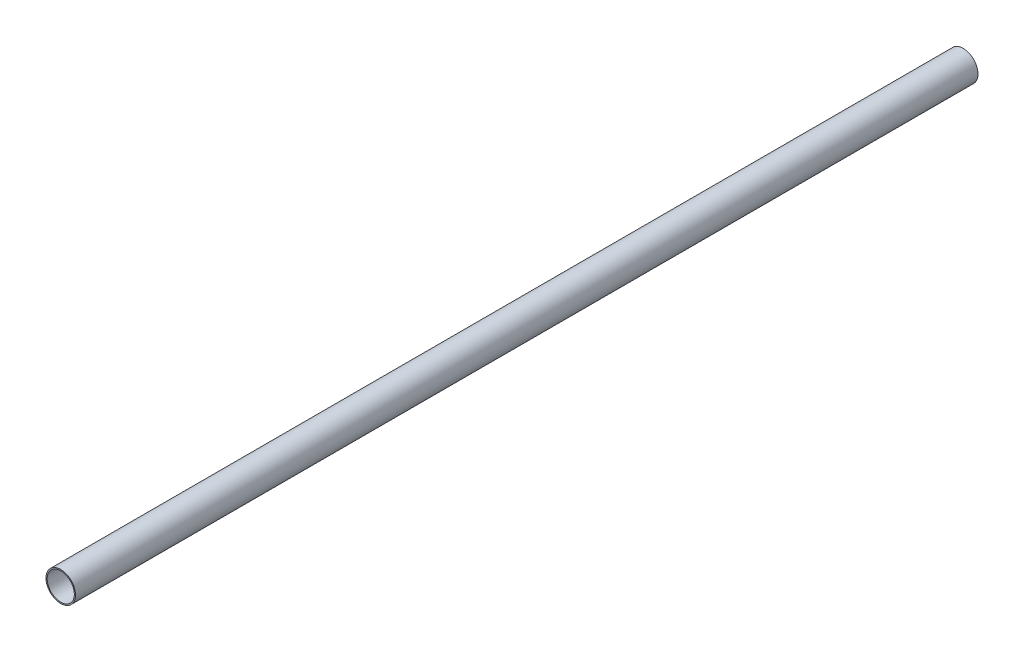
ISO-10303-21;
HEADER;
FILE_DESCRIPTION(('STEP AP214'),'2;1');
FILE_NAME('part.step','',(''),(''),'','','');
FILE_SCHEMA(('AUTOMOTIVE_DESIGN { 1 0 10303 214 1 1 1 1 }'));
ENDSEC;
DATA;
#1=APPLICATION_CONTEXT('core data for automotive mechanical design processes');
#2=APPLICATION_PROTOCOL_DEFINITION('international standard','automotive_design',2000,#1);
#3=PRODUCT_CONTEXT('',#1,'mechanical');
#4=PRODUCT('Part','Part','',(#3));
#5=PRODUCT_RELATED_PRODUCT_CATEGORY('part','',(#4));
#6=PRODUCT_DEFINITION_FORMATION('','',#4);
#7=PRODUCT_DEFINITION_CONTEXT('part definition',#1,'design');
#8=PRODUCT_DEFINITION('design','',#6,#7);
#9=PRODUCT_DEFINITION_SHAPE('','',#8);
#10=(LENGTH_UNIT() NAMED_UNIT(*) SI_UNIT(.MILLI.,.METRE.));
#11=(NAMED_UNIT(*) PLANE_ANGLE_UNIT() SI_UNIT($,.RADIAN.));
#12=(NAMED_UNIT(*) SI_UNIT($,.STERADIAN.) SOLID_ANGLE_UNIT());
#13=UNCERTAINTY_MEASURE_WITH_UNIT(LENGTH_MEASURE(1.E-05),#10,'distance_accuracy_value','');
#14=(GEOMETRIC_REPRESENTATION_CONTEXT(3) GLOBAL_UNCERTAINTY_ASSIGNED_CONTEXT((#13)) GLOBAL_UNIT_ASSIGNED_CONTEXT((#10,
#11,#12)) REPRESENTATION_CONTEXT('',''));
#15=CARTESIAN_POINT('',(0.,0.,0.));
#16=DIRECTION('',(0.,0.,1.));
#17=DIRECTION('',(1.,0.,0.));
#18=AXIS2_PLACEMENT_3D('',#15,#16,#17);
#19=CARTESIAN_POINT('',(0.,0.,419.1));
#20=DIRECTION('',(0.,0.,1.));
#21=DIRECTION('',(1.,0.,0.));
#22=AXIS2_PLACEMENT_3D('',#19,#20,#21);
#23=PLANE('',#22);
#24=CARTESIAN_POINT('',(0.,0.,419.1));
#25=DIRECTION('',(0.,0.,1.));
#26=DIRECTION('',(1.,0.,0.));
#27=AXIS2_PLACEMENT_3D('',#24,#25,#26);
#28=CIRCLE('',#27,13.716);
#29=CARTESIAN_POINT('',(13.716,0.,419.1));
#30=VERTEX_POINT('',#29);
#31=EDGE_CURVE('E11',#30,#30,#28,.T.);
#32=ORIENTED_EDGE('',*,*,#31,.T.);
#33=EDGE_LOOP('',(#32));
#34=FACE_BOUND('',#33,.T.);
#35=CARTESIAN_POINT('',(0.,0.,419.1));
#36=DIRECTION('',(0.,0.,1.));
#37=DIRECTION('',(1.,0.,0.));
#38=AXIS2_PLACEMENT_3D('',#35,#36,#37);
#39=CIRCLE('',#38,12.6238);
#40=CARTESIAN_POINT('',(12.6238,0.,419.1));
#41=VERTEX_POINT('',#40);
#42=EDGE_CURVE('E48',#41,#41,#39,.T.);
#43=ORIENTED_EDGE('',*,*,#42,.F.);
#44=EDGE_LOOP('',(#43));
#45=FACE_BOUND('',#44,.T.);
#46=ADVANCED_FACE('F37',(#34,#45),#23,.T.);
#47=CARTESIAN_POINT('',(0.,0.,-419.1));
#48=DIRECTION('',(0.,0.,1.));
#49=DIRECTION('',(1.,0.,0.));
#50=AXIS2_PLACEMENT_3D('',#47,#48,#49);
#51=PLANE('',#50);
#52=CARTESIAN_POINT('',(0.,0.,-419.1));
#53=DIRECTION('',(0.,0.,1.));
#54=DIRECTION('',(1.,0.,0.));
#55=AXIS2_PLACEMENT_3D('',#52,#53,#54);
#56=CIRCLE('',#55,13.716);
#57=CARTESIAN_POINT('',(13.716,0.,-419.1));
#58=VERTEX_POINT('',#57);
#59=EDGE_CURVE('E41',#58,#58,#56,.T.);
#60=ORIENTED_EDGE('',*,*,#59,.F.);
#61=EDGE_LOOP('',(#60));
#62=FACE_BOUND('',#61,.T.);
#63=CARTESIAN_POINT('',(0.,0.,-419.1));
#64=DIRECTION('',(0.,0.,1.));
#65=DIRECTION('',(1.,0.,0.));
#66=AXIS2_PLACEMENT_3D('',#63,#64,#65);
#67=CIRCLE('',#66,12.6238);
#68=CARTESIAN_POINT('',(12.6238,0.,-419.1));
#69=VERTEX_POINT('',#68);
#70=EDGE_CURVE('E50',#69,#69,#67,.T.);
#71=ORIENTED_EDGE('',*,*,#70,.T.);
#72=EDGE_LOOP('',(#71));
#73=FACE_BOUND('',#72,.T.);
#74=ADVANCED_FACE('F60',(#62,#73),#51,.F.);
#75=CARTESIAN_POINT('',(0.,0.,419.1));
#76=DIRECTION('',(0.,0.,-1.));
#77=DIRECTION('',(-1.,0.,0.));
#78=AXIS2_PLACEMENT_3D('',#75,#76,#77);
#79=CYLINDRICAL_SURFACE('',#78,13.716);
#80=ORIENTED_EDGE('',*,*,#31,.F.);
#81=EDGE_LOOP('',(#80));
#82=FACE_BOUND('',#81,.T.);
#83=ORIENTED_EDGE('',*,*,#59,.T.);
#84=EDGE_LOOP('',(#83));
#85=FACE_BOUND('',#84,.T.);
#86=ADVANCED_FACE('F39',(#82,#85),#79,.T.);
#87=CARTESIAN_POINT('',(0.,0.,419.1));
#88=DIRECTION('',(0.,0.,-1.));
#89=DIRECTION('',(-1.,0.,0.));
#90=AXIS2_PLACEMENT_3D('',#87,#88,#89);
#91=CYLINDRICAL_SURFACE('',#90,12.6238);
#92=ORIENTED_EDGE('',*,*,#42,.T.);
#93=EDGE_LOOP('',(#92));
#94=FACE_BOUND('',#93,.T.);
#95=ORIENTED_EDGE('',*,*,#70,.F.);
#96=EDGE_LOOP('',(#95));
#97=FACE_BOUND('',#96,.T.);
#98=ADVANCED_FACE('F56',(#94,#97),#91,.F.);
#99=CLOSED_SHELL('',(#46,#74,#86,#98));
#100=MANIFOLD_SOLID_BREP('B2',#99);
#101=ADVANCED_BREP_SHAPE_REPRESENTATION('',(#18,#100),#14);
#102=SHAPE_DEFINITION_REPRESENTATION(#9,#101);
ENDSEC;
END-ISO-10303-21;
